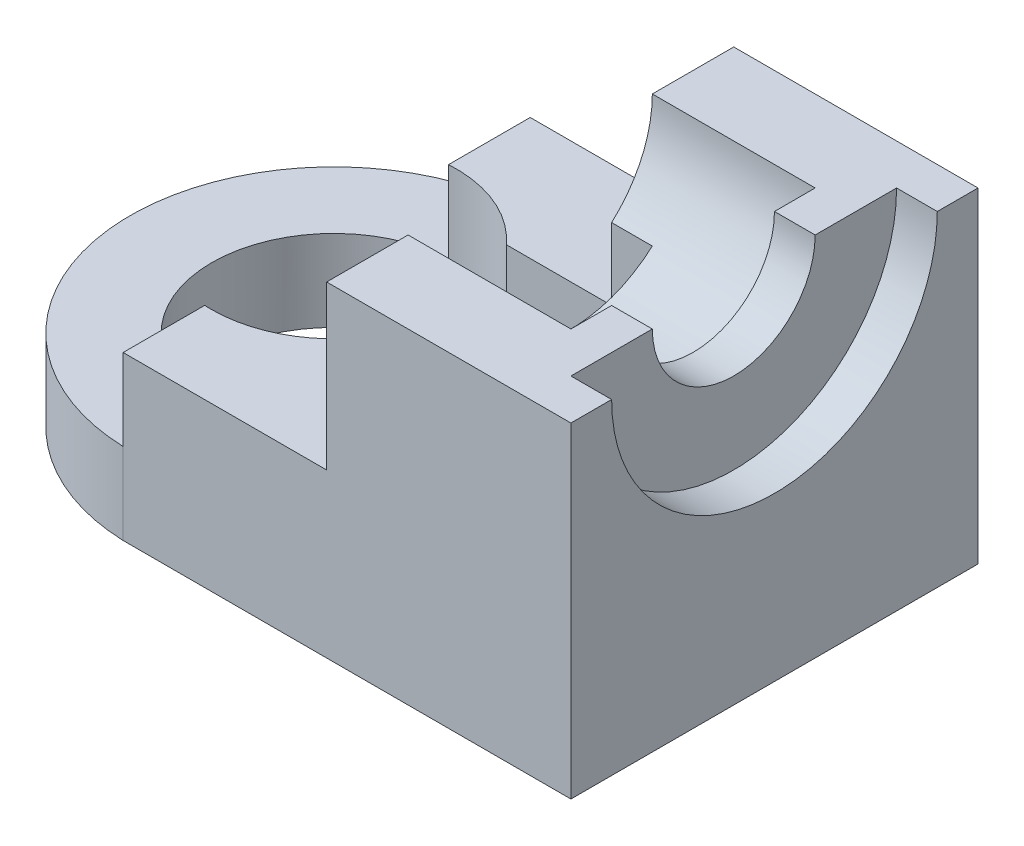
ISO-10303-21;
HEADER;
FILE_DESCRIPTION(('STEP AP214'),'2;1');
FILE_NAME('part.step','',(''),(''),'','','');
FILE_SCHEMA(('AUTOMOTIVE_DESIGN { 1 0 10303 214 1 1 1 1 }'));
ENDSEC;
DATA;
#1=APPLICATION_CONTEXT('core data for automotive mechanical design processes');
#2=APPLICATION_PROTOCOL_DEFINITION('international standard','automotive_design',2000,#1);
#3=PRODUCT_CONTEXT('',#1,'mechanical');
#4=PRODUCT('Part','Part','',(#3));
#5=PRODUCT_RELATED_PRODUCT_CATEGORY('part','',(#4));
#6=PRODUCT_DEFINITION_FORMATION('','',#4);
#7=PRODUCT_DEFINITION_CONTEXT('part definition',#1,'design');
#8=PRODUCT_DEFINITION('design','',#6,#7);
#9=PRODUCT_DEFINITION_SHAPE('','',#8);
#10=(LENGTH_UNIT() NAMED_UNIT(*) SI_UNIT(.MILLI.,.METRE.));
#11=(NAMED_UNIT(*) PLANE_ANGLE_UNIT() SI_UNIT($,.RADIAN.));
#12=(NAMED_UNIT(*) SI_UNIT($,.STERADIAN.) SOLID_ANGLE_UNIT());
#13=UNCERTAINTY_MEASURE_WITH_UNIT(LENGTH_MEASURE(1.E-05),#10,'distance_accuracy_value','');
#14=(GEOMETRIC_REPRESENTATION_CONTEXT(3) GLOBAL_UNCERTAINTY_ASSIGNED_CONTEXT((#13)) GLOBAL_UNIT_ASSIGNED_CONTEXT((#10,
#11,#12)) REPRESENTATION_CONTEXT('',''));
#15=CARTESIAN_POINT('',(0.,0.,0.));
#16=DIRECTION('',(0.,0.,1.));
#17=DIRECTION('',(1.,0.,0.));
#18=AXIS2_PLACEMENT_3D('',#15,#16,#17);
#19=CARTESIAN_POINT('',(5.17622924952847,-14.,0.));
#20=DIRECTION('',(0.,1.,0.));
#21=DIRECTION('',(0.,0.,1.));
#22=AXIS2_PLACEMENT_3D('',#19,#20,#21);
#23=CYLINDRICAL_SURFACE('',#22,3.);
#24=CARTESIAN_POINT('',(5.17622924952847,-4.,0.));
#25=DIRECTION('',(0.,1.,0.));
#26=DIRECTION('',(0.,0.,1.));
#27=AXIS2_PLACEMENT_3D('',#24,#25,#26);
#28=CIRCLE('',#27,3.);
#29=CARTESIAN_POINT('',(5.17622924952847,-4.,3.));
#30=VERTEX_POINT('',#29);
#31=EDGE_CURVE('E289',#30,#30,#28,.T.);
#32=ORIENTED_EDGE('',*,*,#31,.F.);
#33=EDGE_LOOP('',(#32));
#34=FACE_BOUND('',#33,.T.);
#35=DIRECTION('',(0.,1.,0.));
#36=VECTOR('',#35,1.);
#37=CARTESIAN_POINT('',(7.41229722702826,-14.,-2.00000000000001));
#38=LINE('',#37,#36);
#39=CARTESIAN_POINT('',(7.41229722702826,0.,-2.));
#40=VERTEX_POINT('',#39);
#41=CARTESIAN_POINT('',(7.41229722702826,-2.,-2.));
#42=VERTEX_POINT('',#41);
#43=EDGE_CURVE('E191',#40,#42,#38,.F.);
#44=ORIENTED_EDGE('',*,*,#43,.F.);
#45=CARTESIAN_POINT('',(5.17622924952847,0.,0.));
#46=DIRECTION('',(0.,1.,0.));
#47=DIRECTION('',(0.,0.,1.));
#48=AXIS2_PLACEMENT_3D('',#45,#46,#47);
#49=CIRCLE('',#48,3.);
#50=CARTESIAN_POINT('',(5.,0.,-2.99481940216946));
#51=VERTEX_POINT('',#50);
#52=EDGE_CURVE('E234',#51,#40,#49,.F.);
#53=ORIENTED_EDGE('',*,*,#52,.F.);
#54=DIRECTION('',(0.,1.,0.));
#55=VECTOR('',#54,1.);
#56=CARTESIAN_POINT('',(5.,-14.,-2.99481940216946));
#57=LINE('',#56,#55);
#58=CARTESIAN_POINT('',(5.,-2.,-2.99481940216946));
#59=VERTEX_POINT('',#58);
#60=EDGE_CURVE('E243',#51,#59,#57,.F.);
#61=ORIENTED_EDGE('',*,*,#60,.T.);
#62=CARTESIAN_POINT('',(5.17622924952847,-2.,0.));
#63=DIRECTION('',(0.,-1.,0.));
#64=DIRECTION('',(0.,0.,-1.));
#65=AXIS2_PLACEMENT_3D('',#62,#63,#64);
#66=CIRCLE('',#65,3.);
#67=CARTESIAN_POINT('',(5.,-2.,2.99481940216946));
#68=VERTEX_POINT('',#67);
#69=EDGE_CURVE('E329',#59,#68,#66,.F.);
#70=ORIENTED_EDGE('',*,*,#69,.T.);
#71=DIRECTION('',(0.,1.,0.));
#72=VECTOR('',#71,1.);
#73=CARTESIAN_POINT('',(5.,-14.,2.99481940216945));
#74=LINE('',#73,#72);
#75=CARTESIAN_POINT('',(5.,0.,2.99481940216946));
#76=VERTEX_POINT('',#75);
#77=EDGE_CURVE('E245',#68,#76,#74,.T.);
#78=ORIENTED_EDGE('',*,*,#77,.T.);
#79=CARTESIAN_POINT('',(7.41229722702826,0.,2.));
#80=VERTEX_POINT('',#79);
#81=EDGE_CURVE('E232',#80,#76,#49,.F.);
#82=ORIENTED_EDGE('',*,*,#81,.F.);
#83=DIRECTION('',(0.,1.,0.));
#84=VECTOR('',#83,1.);
#85=CARTESIAN_POINT('',(7.41229722702826,-14.,1.99999999999999));
#86=LINE('',#85,#84);
#87=CARTESIAN_POINT('',(7.41229722702826,-2.,2.));
#88=VERTEX_POINT('',#87);
#89=EDGE_CURVE('E206',#88,#80,#86,.T.);
#90=ORIENTED_EDGE('',*,*,#89,.F.);
#91=CARTESIAN_POINT('',(5.17622924952847,-2.,0.));
#92=DIRECTION('',(0.,-1.,0.));
#93=DIRECTION('',(0.,0.,-1.));
#94=AXIS2_PLACEMENT_3D('',#91,#92,#93);
#95=CIRCLE('',#94,3.);
#96=EDGE_CURVE('E11',#88,#42,#95,.F.);
#97=ORIENTED_EDGE('',*,*,#96,.T.);
#98=EDGE_LOOP('',(#44,#53,#61,#70,#78,#82,#90,#97));
#99=FACE_BOUND('',#98,.T.);
#100=ADVANCED_FACE('F33',(#34,#99),#23,.F.);
#101=CARTESIAN_POINT('',(14.,4.,0.));
#102=DIRECTION('',(-1.,0.,0.));
#103=DIRECTION('',(0.,0.,1.));
#104=AXIS2_PLACEMENT_3D('',#101,#102,#103);
#105=CYLINDRICAL_SURFACE('',#104,3.);
#106=CARTESIAN_POINT('',(10.,4.,0.));
#107=DIRECTION('',(1.,0.,0.));
#108=DIRECTION('',(0.,0.,-1.));
#109=AXIS2_PLACEMENT_3D('',#106,#107,#108);
#110=CIRCLE('',#109,3.);
#111=CARTESIAN_POINT('',(10.,1.76393202250021,-2.));
#112=VERTEX_POINT('',#111);
#113=CARTESIAN_POINT('',(10.,4.,-3.));
#114=VERTEX_POINT('',#113);
#115=EDGE_CURVE('E332',#112,#114,#110,.T.);
#116=ORIENTED_EDGE('',*,*,#115,.F.);
#117=DIRECTION('',(-1.,0.,0.));
#118=VECTOR('',#117,1.);
#119=CARTESIAN_POINT('',(14.,1.76393202250021,-2.));
#120=LINE('',#119,#118);
#121=CARTESIAN_POINT('',(11.,1.76393202250021,-2.));
#122=VERTEX_POINT('',#121);
#123=EDGE_CURVE('E211',#112,#122,#120,.F.);
#124=ORIENTED_EDGE('',*,*,#123,.T.);
#125=CARTESIAN_POINT('',(11.,4.,0.));
#126=DIRECTION('',(-1.,0.,0.));
#127=DIRECTION('',(0.,0.,1.));
#128=AXIS2_PLACEMENT_3D('',#125,#126,#127);
#129=CIRCLE('',#128,3.);
#130=CARTESIAN_POINT('',(11.,1.76393202250021,2.));
#131=VERTEX_POINT('',#130);
#132=EDGE_CURVE('E41',#122,#131,#129,.T.);
#133=ORIENTED_EDGE('',*,*,#132,.T.);
#134=DIRECTION('',(-1.,0.,0.));
#135=VECTOR('',#134,1.);
#136=CARTESIAN_POINT('',(14.,1.76393202250021,2.));
#137=LINE('',#136,#135);
#138=CARTESIAN_POINT('',(10.,1.76393202250021,2.));
#139=VERTEX_POINT('',#138);
#140=EDGE_CURVE('E203',#131,#139,#137,.T.);
#141=ORIENTED_EDGE('',*,*,#140,.T.);
#142=CARTESIAN_POINT('',(10.,4.,3.));
#143=VERTEX_POINT('',#142);
#144=EDGE_CURVE('E333',#143,#139,#110,.T.);
#145=ORIENTED_EDGE('',*,*,#144,.F.);
#146=DIRECTION('',(-1.,0.,0.));
#147=VECTOR('',#146,1.);
#148=CARTESIAN_POINT('',(14.,4.,3.));
#149=LINE('',#148,#147);
#150=CARTESIAN_POINT('',(14.,4.,3.));
#151=VERTEX_POINT('',#150);
#152=EDGE_CURVE('E256',#143,#151,#149,.F.);
#153=ORIENTED_EDGE('',*,*,#152,.T.);
#154=CARTESIAN_POINT('',(14.,4.,0.));
#155=DIRECTION('',(1.,0.,0.));
#156=DIRECTION('',(0.,0.,-1.));
#157=AXIS2_PLACEMENT_3D('',#154,#155,#156);
#158=CIRCLE('',#157,3.);
#159=CARTESIAN_POINT('',(14.,4.,-3.));
#160=VERTEX_POINT('',#159);
#161=EDGE_CURVE('E253',#151,#160,#158,.T.);
#162=ORIENTED_EDGE('',*,*,#161,.T.);
#163=DIRECTION('',(-1.,0.,0.));
#164=VECTOR('',#163,1.);
#165=CARTESIAN_POINT('',(14.,4.,-3.));
#166=LINE('',#165,#164);
#167=EDGE_CURVE('E258',#160,#114,#166,.T.);
#168=ORIENTED_EDGE('',*,*,#167,.T.);
#169=EDGE_LOOP('',(#116,#124,#133,#141,#145,#153,#162,#168));
#170=FACE_BOUND('',#169,.T.);
#171=ADVANCED_FACE('F341',(#170),#105,.F.);
#172=CARTESIAN_POINT('',(0.,0.,0.));
#173=DIRECTION('',(0.,1.,0.));
#174=DIRECTION('',(0.,0.,1.));
#175=AXIS2_PLACEMENT_3D('',#172,#173,#174);
#176=PLANE('',#175);
#177=ORIENTED_EDGE('',*,*,#52,.T.);
#178=DIRECTION('',(1.,0.,0.));
#179=VECTOR('',#178,1.);
#180=CARTESIAN_POINT('',(0.,0.,-2.));
#181=LINE('',#180,#179);
#182=CARTESIAN_POINT('',(10.,0.,-2.));
#183=VERTEX_POINT('',#182);
#184=EDGE_CURVE('E208',#40,#183,#181,.T.);
#185=ORIENTED_EDGE('',*,*,#184,.T.);
#186=DIRECTION('',(0.,0.,-1.));
#187=VECTOR('',#186,1.);
#188=CARTESIAN_POINT('',(10.,0.,-5.));
#189=LINE('',#188,#187);
#190=CARTESIAN_POINT('',(10.,0.,-5.));
#191=VERTEX_POINT('',#190);
#192=EDGE_CURVE('E221',#183,#191,#189,.T.);
#193=ORIENTED_EDGE('',*,*,#192,.T.);
#194=DIRECTION('',(-1.,0.,0.));
#195=VECTOR('',#194,1.);
#196=CARTESIAN_POINT('',(5.,0.,-5.));
#197=LINE('',#196,#195);
#198=CARTESIAN_POINT('',(5.,0.,-5.));
#199=VERTEX_POINT('',#198);
#200=EDGE_CURVE('E56',#191,#199,#197,.T.);
#201=ORIENTED_EDGE('',*,*,#200,.T.);
#202=DIRECTION('',(0.,0.,1.));
#203=VECTOR('',#202,1.);
#204=CARTESIAN_POINT('',(5.,0.,-5.));
#205=LINE('',#204,#203);
#206=EDGE_CURVE('E215',#199,#51,#205,.T.);
#207=ORIENTED_EDGE('',*,*,#206,.T.);
#208=EDGE_LOOP('',(#177,#185,#193,#201,#207));
#209=FACE_BOUND('',#208,.T.);
#210=ADVANCED_FACE('F349',(#209),#176,.T.);
#211=CARTESIAN_POINT('',(10.,0.,5.));
#212=VERTEX_POINT('',#211);
#213=CARTESIAN_POINT('',(10.,0.,2.));
#214=VERTEX_POINT('',#213);
#215=EDGE_CURVE('E222',#212,#214,#189,.T.);
#216=ORIENTED_EDGE('',*,*,#215,.T.);
#217=DIRECTION('',(-1.,0.,0.));
#218=VECTOR('',#217,1.);
#219=CARTESIAN_POINT('',(0.,0.,2.));
#220=LINE('',#219,#218);
#221=EDGE_CURVE('E48',#214,#80,#220,.T.);
#222=ORIENTED_EDGE('',*,*,#221,.T.);
#223=ORIENTED_EDGE('',*,*,#81,.T.);
#224=CARTESIAN_POINT('',(5.,0.,5.));
#225=VERTEX_POINT('',#224);
#226=EDGE_CURVE('E218',#76,#225,#205,.T.);
#227=ORIENTED_EDGE('',*,*,#226,.T.);
#228=DIRECTION('',(1.,0.,0.));
#229=VECTOR('',#228,1.);
#230=CARTESIAN_POINT('',(5.,0.,5.));
#231=LINE('',#230,#229);
#232=EDGE_CURVE('E217',#225,#212,#231,.T.);
#233=ORIENTED_EDGE('',*,*,#232,.T.);
#234=EDGE_LOOP('',(#216,#222,#223,#227,#233));
#235=FACE_BOUND('',#234,.T.);
#236=ADVANCED_FACE('F359',(#235),#176,.T.);
#237=CARTESIAN_POINT('',(10.,0.,-5.));
#238=DIRECTION('',(1.,0.,0.));
#239=DIRECTION('',(0.,0.,-1.));
#240=AXIS2_PLACEMENT_3D('',#237,#238,#239);
#241=PLANE('',#240);
#242=DIRECTION('',(0.,-1.,0.));
#243=VECTOR('',#242,1.);
#244=CARTESIAN_POINT('',(10.,0.,-2.));
#245=LINE('',#244,#243);
#246=EDGE_CURVE('E338',#112,#183,#245,.T.);
#247=ORIENTED_EDGE('',*,*,#246,.F.);
#248=ORIENTED_EDGE('',*,*,#115,.T.);
#249=DIRECTION('',(0.,0.,-1.));
#250=VECTOR('',#249,1.);
#251=CARTESIAN_POINT('',(10.,4.,-5.));
#252=LINE('',#251,#250);
#253=CARTESIAN_POINT('',(10.,4.,-5.));
#254=VERTEX_POINT('',#253);
#255=EDGE_CURVE('E214',#114,#254,#252,.T.);
#256=ORIENTED_EDGE('',*,*,#255,.T.);
#257=DIRECTION('',(0.,1.,0.));
#258=VECTOR('',#257,1.);
#259=CARTESIAN_POINT('',(10.,0.,-5.));
#260=LINE('',#259,#258);
#261=EDGE_CURVE('E229',#191,#254,#260,.T.);
#262=ORIENTED_EDGE('',*,*,#261,.F.);
#263=ORIENTED_EDGE('',*,*,#192,.F.);
#264=EDGE_LOOP('',(#247,#248,#256,#262,#263));
#265=FACE_BOUND('',#264,.T.);
#266=ADVANCED_FACE('F346',(#265),#241,.F.);
#267=DIRECTION('',(0.,1.,0.));
#268=VECTOR('',#267,1.);
#269=CARTESIAN_POINT('',(10.,0.,2.));
#270=LINE('',#269,#268);
#271=EDGE_CURVE('E336',#214,#139,#270,.T.);
#272=ORIENTED_EDGE('',*,*,#271,.F.);
#273=ORIENTED_EDGE('',*,*,#215,.F.);
#274=DIRECTION('',(0.,1.,0.));
#275=VECTOR('',#274,1.);
#276=CARTESIAN_POINT('',(10.,0.,5.));
#277=LINE('',#276,#275);
#278=CARTESIAN_POINT('',(10.,4.,5.));
#279=VERTEX_POINT('',#278);
#280=EDGE_CURVE('E226',#212,#279,#277,.T.);
#281=ORIENTED_EDGE('',*,*,#280,.T.);
#282=EDGE_CURVE('E227',#279,#143,#252,.T.);
#283=ORIENTED_EDGE('',*,*,#282,.T.);
#284=ORIENTED_EDGE('',*,*,#144,.T.);
#285=EDGE_LOOP('',(#272,#273,#281,#283,#284));
#286=FACE_BOUND('',#285,.T.);
#287=ADVANCED_FACE('F357',(#286),#241,.F.);
#288=CARTESIAN_POINT('',(5.,-2.,-5.));
#289=DIRECTION('',(1.,0.,0.));
#290=DIRECTION('',(0.,0.,-1.));
#291=AXIS2_PLACEMENT_3D('',#288,#289,#290);
#292=PLANE('',#291);
#293=ORIENTED_EDGE('',*,*,#226,.F.);
#294=ORIENTED_EDGE('',*,*,#77,.F.);
#295=DIRECTION('',(0.,0.,-1.));
#296=VECTOR('',#295,1.);
#297=CARTESIAN_POINT('',(5.,-2.,-5.));
#298=LINE('',#297,#296);
#299=CARTESIAN_POINT('',(5.,-2.,5.));
#300=VERTEX_POINT('',#299);
#301=EDGE_CURVE('E239',#300,#68,#298,.T.);
#302=ORIENTED_EDGE('',*,*,#301,.F.);
#303=DIRECTION('',(0.,-1.,0.));
#304=VECTOR('',#303,1.);
#305=CARTESIAN_POINT('',(5.,-4.,5.));
#306=LINE('',#305,#304);
#307=EDGE_CURVE('E248',#225,#300,#306,.T.);
#308=ORIENTED_EDGE('',*,*,#307,.F.);
#309=EDGE_LOOP('',(#293,#294,#302,#308));
#310=FACE_BOUND('',#309,.T.);
#311=ADVANCED_FACE('F412',(#310),#292,.F.);
#312=ORIENTED_EDGE('',*,*,#206,.F.);
#313=DIRECTION('',(0.,1.,0.));
#314=VECTOR('',#313,1.);
#315=CARTESIAN_POINT('',(5.,-2.,-5.));
#316=LINE('',#315,#314);
#317=CARTESIAN_POINT('',(5.,-2.,-5.));
#318=VERTEX_POINT('',#317);
#319=EDGE_CURVE('E240',#318,#199,#316,.T.);
#320=ORIENTED_EDGE('',*,*,#319,.F.);
#321=EDGE_CURVE('E237',#59,#318,#298,.T.);
#322=ORIENTED_EDGE('',*,*,#321,.F.);
#323=ORIENTED_EDGE('',*,*,#60,.F.);
#324=EDGE_LOOP('',(#312,#320,#322,#323));
#325=FACE_BOUND('',#324,.T.);
#326=ADVANCED_FACE('F401',(#325),#292,.F.);
#327=CARTESIAN_POINT('',(16.,4.,-5.));
#328=DIRECTION('',(0.,-1.,0.));
#329=DIRECTION('',(0.,0.,-1.));
#330=AXIS2_PLACEMENT_3D('',#327,#328,#329);
#331=PLANE('',#330);
#332=DIRECTION('',(-1.,0.,0.));
#333=VECTOR('',#332,1.);
#334=CARTESIAN_POINT('',(16.,4.,-5.));
#335=LINE('',#334,#333);
#336=CARTESIAN_POINT('',(16.,4.,-5.));
#337=VERTEX_POINT('',#336);
#338=EDGE_CURVE('E313',#337,#254,#335,.T.);
#339=ORIENTED_EDGE('',*,*,#338,.T.);
#340=ORIENTED_EDGE('',*,*,#255,.F.);
#341=ORIENTED_EDGE('',*,*,#167,.F.);
#342=DIRECTION('',(0.,0.,1.));
#343=VECTOR('',#342,1.);
#344=CARTESIAN_POINT('',(14.,4.,-5.));
#345=LINE('',#344,#343);
#346=CARTESIAN_POINT('',(14.,4.,-2.));
#347=VERTEX_POINT('',#346);
#348=EDGE_CURVE('E264',#160,#347,#345,.T.);
#349=ORIENTED_EDGE('',*,*,#348,.T.);
#350=DIRECTION('',(-1.,0.,0.));
#351=VECTOR('',#350,1.);
#352=CARTESIAN_POINT('',(16.,4.,-2.));
#353=LINE('',#352,#351);
#354=CARTESIAN_POINT('',(15.,4.,-2.));
#355=VERTEX_POINT('',#354);
#356=EDGE_CURVE('E310',#355,#347,#353,.T.);
#357=ORIENTED_EDGE('',*,*,#356,.F.);
#358=DIRECTION('',(0.,0.,1.));
#359=VECTOR('',#358,1.);
#360=CARTESIAN_POINT('',(15.,4.,-5.));
#361=LINE('',#360,#359);
#362=CARTESIAN_POINT('',(15.,4.,-4.));
#363=VERTEX_POINT('',#362);
#364=EDGE_CURVE('E278',#363,#355,#361,.T.);
#365=ORIENTED_EDGE('',*,*,#364,.F.);
#366=DIRECTION('',(1.,0.,0.));
#367=VECTOR('',#366,1.);
#368=CARTESIAN_POINT('',(15.,4.,-4.));
#369=LINE('',#368,#367);
#370=CARTESIAN_POINT('',(16.,4.,-4.));
#371=VERTEX_POINT('',#370);
#372=EDGE_CURVE('E273',#363,#371,#369,.T.);
#373=ORIENTED_EDGE('',*,*,#372,.T.);
#374=DIRECTION('',(0.,0.,1.));
#375=VECTOR('',#374,1.);
#376=CARTESIAN_POINT('',(16.,4.,-5.));
#377=LINE('',#376,#375);
#378=EDGE_CURVE('E299',#337,#371,#377,.T.);
#379=ORIENTED_EDGE('',*,*,#378,.F.);
#380=EDGE_LOOP('',(#339,#340,#341,#349,#357,#365,#373,#379));
#381=FACE_BOUND('',#380,.T.);
#382=ADVANCED_FACE('F378',(#381),#331,.F.);
#383=CARTESIAN_POINT('',(16.,4.,2.));
#384=DIRECTION('',(0.,-1.,0.));
#385=DIRECTION('',(0.,0.,-1.));
#386=AXIS2_PLACEMENT_3D('',#383,#384,#385);
#387=PLANE('',#386);
#388=ORIENTED_EDGE('',*,*,#152,.F.);
#389=ORIENTED_EDGE('',*,*,#282,.F.);
#390=DIRECTION('',(-1.,0.,0.));
#391=VECTOR('',#390,1.);
#392=CARTESIAN_POINT('',(16.,4.,5.));
#393=LINE('',#392,#391);
#394=CARTESIAN_POINT('',(16.,4.,5.));
#395=VERTEX_POINT('',#394);
#396=EDGE_CURVE('E304',#395,#279,#393,.T.);
#397=ORIENTED_EDGE('',*,*,#396,.F.);
#398=DIRECTION('',(0.,0.,1.));
#399=VECTOR('',#398,1.);
#400=CARTESIAN_POINT('',(16.,4.,2.));
#401=LINE('',#400,#399);
#402=CARTESIAN_POINT('',(16.,4.,4.));
#403=VERTEX_POINT('',#402);
#404=EDGE_CURVE('E302',#403,#395,#401,.T.);
#405=ORIENTED_EDGE('',*,*,#404,.F.);
#406=DIRECTION('',(1.,0.,0.));
#407=VECTOR('',#406,1.);
#408=CARTESIAN_POINT('',(15.,4.,4.));
#409=LINE('',#408,#407);
#410=CARTESIAN_POINT('',(15.,4.,4.));
#411=VERTEX_POINT('',#410);
#412=EDGE_CURVE('E270',#403,#411,#409,.F.);
#413=ORIENTED_EDGE('',*,*,#412,.T.);
#414=DIRECTION('',(0.,0.,1.));
#415=VECTOR('',#414,1.);
#416=CARTESIAN_POINT('',(15.,4.,2.));
#417=LINE('',#416,#415);
#418=CARTESIAN_POINT('',(15.,4.,2.));
#419=VERTEX_POINT('',#418);
#420=EDGE_CURVE('E324',#419,#411,#417,.T.);
#421=ORIENTED_EDGE('',*,*,#420,.F.);
#422=DIRECTION('',(-1.,0.,0.));
#423=VECTOR('',#422,1.);
#424=CARTESIAN_POINT('',(16.,4.,2.));
#425=LINE('',#424,#423);
#426=CARTESIAN_POINT('',(14.,4.,2.));
#427=VERTEX_POINT('',#426);
#428=EDGE_CURVE('E307',#419,#427,#425,.T.);
#429=ORIENTED_EDGE('',*,*,#428,.T.);
#430=DIRECTION('',(0.,0.,1.));
#431=VECTOR('',#430,1.);
#432=CARTESIAN_POINT('',(14.,4.,2.));
#433=LINE('',#432,#431);
#434=EDGE_CURVE('E326',#427,#151,#433,.T.);
#435=ORIENTED_EDGE('',*,*,#434,.T.);
#436=EDGE_LOOP('',(#388,#389,#397,#405,#413,#421,#429,#435));
#437=FACE_BOUND('',#436,.T.);
#438=ADVANCED_FACE('F370',(#437),#387,.F.);
#439=CARTESIAN_POINT('',(5.17622924952847,-14.,0.));
#440=DIRECTION('',(0.,1.,0.));
#441=DIRECTION('',(0.,0.,1.));
#442=AXIS2_PLACEMENT_3D('',#439,#440,#441);
#443=CYLINDRICAL_SURFACE('',#442,5.00310471091595);
#444=DIRECTION('',(0.,1.,0.));
#445=VECTOR('',#444,1.);
#446=CARTESIAN_POINT('',(5.,-14.,4.99999999999999));
#447=LINE('',#446,#445);
#448=CARTESIAN_POINT('',(5.,-4.,5.));
#449=VERTEX_POINT('',#448);
#450=EDGE_CURVE('E281',#449,#300,#447,.T.);
#451=ORIENTED_EDGE('',*,*,#450,.T.);
#452=CARTESIAN_POINT('',(5.17622924952847,-2.,0.));
#453=DIRECTION('',(0.,-1.,0.));
#454=DIRECTION('',(0.,0.,-1.));
#455=AXIS2_PLACEMENT_3D('',#452,#453,#454);
#456=CIRCLE('',#455,5.00310471091595);
#457=EDGE_CURVE('E250',#300,#318,#456,.T.);
#458=ORIENTED_EDGE('',*,*,#457,.T.);
#459=DIRECTION('',(0.,1.,0.));
#460=VECTOR('',#459,1.);
#461=CARTESIAN_POINT('',(5.,-14.,-5.00000000000001));
#462=LINE('',#461,#460);
#463=CARTESIAN_POINT('',(5.,-4.,-5.));
#464=VERTEX_POINT('',#463);
#465=EDGE_CURVE('E280',#464,#318,#462,.T.);
#466=ORIENTED_EDGE('',*,*,#465,.F.);
#467=CARTESIAN_POINT('',(5.17622924952847,-4.,0.));
#468=DIRECTION('',(0.,1.,0.));
#469=DIRECTION('',(0.,0.,1.));
#470=AXIS2_PLACEMENT_3D('',#467,#468,#469);
#471=CIRCLE('',#470,5.00310471091595);
#472=EDGE_CURVE('E284',#449,#464,#471,.F.);
#473=ORIENTED_EDGE('',*,*,#472,.F.);
#474=EDGE_LOOP('',(#451,#458,#466,#473));
#475=FACE_BOUND('',#474,.T.);
#476=ADVANCED_FACE('F404',(#475),#443,.T.);
#477=CARTESIAN_POINT('',(16.,4.,0.));
#478=DIRECTION('',(-1.,0.,0.));
#479=DIRECTION('',(0.,0.,1.));
#480=AXIS2_PLACEMENT_3D('',#477,#478,#479);
#481=CYLINDRICAL_SURFACE('',#480,2.);
#482=ORIENTED_EDGE('',*,*,#356,.T.);
#483=CARTESIAN_POINT('',(14.,4.,0.));
#484=DIRECTION('',(1.,0.,0.));
#485=DIRECTION('',(0.,0.,-1.));
#486=AXIS2_PLACEMENT_3D('',#483,#484,#485);
#487=CIRCLE('',#486,2.);
#488=EDGE_CURVE('E261',#347,#427,#487,.F.);
#489=ORIENTED_EDGE('',*,*,#488,.T.);
#490=ORIENTED_EDGE('',*,*,#428,.F.);
#491=CARTESIAN_POINT('',(15.,4.,0.));
#492=DIRECTION('',(1.,0.,0.));
#493=DIRECTION('',(0.,0.,-1.));
#494=AXIS2_PLACEMENT_3D('',#491,#492,#493);
#495=CIRCLE('',#494,2.);
#496=EDGE_CURVE('E276',#355,#419,#495,.F.);
#497=ORIENTED_EDGE('',*,*,#496,.F.);
#498=EDGE_LOOP('',(#482,#489,#490,#497));
#499=FACE_BOUND('',#498,.T.);
#500=ADVANCED_FACE('F382',(#499),#481,.F.);
#501=CARTESIAN_POINT('',(16.,-4.,5.));
#502=DIRECTION('',(0.,0.,-1.));
#503=DIRECTION('',(-1.,0.,0.));
#504=AXIS2_PLACEMENT_3D('',#501,#502,#503);
#505=PLANE('',#504);
#506=ORIENTED_EDGE('',*,*,#396,.T.);
#507=ORIENTED_EDGE('',*,*,#280,.F.);
#508=ORIENTED_EDGE('',*,*,#232,.F.);
#509=ORIENTED_EDGE('',*,*,#307,.T.);
#510=ORIENTED_EDGE('',*,*,#450,.F.);
#511=DIRECTION('',(-1.,0.,0.));
#512=VECTOR('',#511,1.);
#513=CARTESIAN_POINT('',(16.,-4.,5.));
#514=LINE('',#513,#512);
#515=CARTESIAN_POINT('',(16.,-4.,5.));
#516=VERTEX_POINT('',#515);
#517=EDGE_CURVE('E319',#516,#449,#514,.T.);
#518=ORIENTED_EDGE('',*,*,#517,.F.);
#519=DIRECTION('',(0.,-1.,0.));
#520=VECTOR('',#519,1.);
#521=CARTESIAN_POINT('',(16.,-4.,5.));
#522=LINE('',#521,#520);
#523=EDGE_CURVE('E292',#395,#516,#522,.T.);
#524=ORIENTED_EDGE('',*,*,#523,.F.);
#525=EDGE_LOOP('',(#506,#507,#508,#509,#510,#518,#524));
#526=FACE_BOUND('',#525,.T.);
#527=ADVANCED_FACE('F35',(#526),#505,.F.);
#528=CARTESIAN_POINT('',(16.,-4.,-5.));
#529=DIRECTION('',(0.,1.,0.));
#530=DIRECTION('',(0.,0.,1.));
#531=AXIS2_PLACEMENT_3D('',#528,#529,#530);
#532=PLANE('',#531);
#533=ORIENTED_EDGE('',*,*,#31,.T.);
#534=EDGE_LOOP('',(#533));
#535=FACE_BOUND('',#534,.T.);
#536=ORIENTED_EDGE('',*,*,#517,.T.);
#537=ORIENTED_EDGE('',*,*,#472,.T.);
#538=DIRECTION('',(-1.,0.,0.));
#539=VECTOR('',#538,1.);
#540=CARTESIAN_POINT('',(16.,-4.,-5.));
#541=LINE('',#540,#539);
#542=CARTESIAN_POINT('',(16.,-4.,-5.));
#543=VERTEX_POINT('',#542);
#544=EDGE_CURVE('E316',#543,#464,#541,.T.);
#545=ORIENTED_EDGE('',*,*,#544,.F.);
#546=DIRECTION('',(0.,0.,-1.));
#547=VECTOR('',#546,1.);
#548=CARTESIAN_POINT('',(16.,-4.,-5.));
#549=LINE('',#548,#547);
#550=EDGE_CURVE('E295',#516,#543,#549,.T.);
#551=ORIENTED_EDGE('',*,*,#550,.F.);
#552=EDGE_LOOP('',(#536,#537,#545,#551));
#553=FACE_BOUND('',#552,.T.);
#554=ADVANCED_FACE('F415',(#535,#553),#532,.F.);
#555=CARTESIAN_POINT('',(16.,-4.,-5.));
#556=DIRECTION('',(0.,0.,1.));
#557=DIRECTION('',(1.,0.,0.));
#558=AXIS2_PLACEMENT_3D('',#555,#556,#557);
#559=PLANE('',#558);
#560=ORIENTED_EDGE('',*,*,#200,.F.);
#561=ORIENTED_EDGE('',*,*,#261,.T.);
#562=ORIENTED_EDGE('',*,*,#338,.F.);
#563=DIRECTION('',(0.,1.,0.));
#564=VECTOR('',#563,1.);
#565=CARTESIAN_POINT('',(16.,-4.,-5.));
#566=LINE('',#565,#564);
#567=EDGE_CURVE('E297',#543,#337,#566,.T.);
#568=ORIENTED_EDGE('',*,*,#567,.F.);
#569=ORIENTED_EDGE('',*,*,#544,.T.);
#570=ORIENTED_EDGE('',*,*,#465,.T.);
#571=ORIENTED_EDGE('',*,*,#319,.T.);
#572=EDGE_LOOP('',(#560,#561,#562,#568,#569,#570,#571));
#573=FACE_BOUND('',#572,.T.);
#574=ADVANCED_FACE('F397',(#573),#559,.F.);
#575=CARTESIAN_POINT('',(16.,4.,0.));
#576=DIRECTION('',(1.,0.,0.));
#577=DIRECTION('',(0.,0.,-1.));
#578=AXIS2_PLACEMENT_3D('',#575,#576,#577);
#579=PLANE('',#578);
#580=CARTESIAN_POINT('',(16.,4.,0.));
#581=DIRECTION('',(1.,0.,0.));
#582=DIRECTION('',(0.,0.,-1.));
#583=AXIS2_PLACEMENT_3D('',#580,#581,#582);
#584=CIRCLE('',#583,4.);
#585=EDGE_CURVE('E322',#403,#371,#584,.T.);
#586=ORIENTED_EDGE('',*,*,#585,.F.);
#587=ORIENTED_EDGE('',*,*,#404,.T.);
#588=ORIENTED_EDGE('',*,*,#523,.T.);
#589=ORIENTED_EDGE('',*,*,#550,.T.);
#590=ORIENTED_EDGE('',*,*,#567,.T.);
#591=ORIENTED_EDGE('',*,*,#378,.T.);
#592=EDGE_LOOP('',(#586,#587,#588,#589,#590,#591));
#593=FACE_BOUND('',#592,.T.);
#594=ADVANCED_FACE('F392',(#593),#579,.T.);
#595=CARTESIAN_POINT('',(15.,4.,0.));
#596=DIRECTION('',(1.,0.,0.));
#597=DIRECTION('',(0.,0.,-1.));
#598=AXIS2_PLACEMENT_3D('',#595,#596,#597);
#599=PLANE('',#598);
#600=ORIENTED_EDGE('',*,*,#364,.T.);
#601=ORIENTED_EDGE('',*,*,#496,.T.);
#602=ORIENTED_EDGE('',*,*,#420,.T.);
#603=CARTESIAN_POINT('',(15.,4.,0.));
#604=DIRECTION('',(1.,0.,0.));
#605=DIRECTION('',(0.,0.,-1.));
#606=AXIS2_PLACEMENT_3D('',#603,#604,#605);
#607=CIRCLE('',#606,4.);
#608=EDGE_CURVE('E267',#411,#363,#607,.T.);
#609=ORIENTED_EDGE('',*,*,#608,.T.);
#610=EDGE_LOOP('',(#600,#601,#602,#609));
#611=FACE_BOUND('',#610,.T.);
#612=ADVANCED_FACE('F386',(#611),#599,.T.);
#613=CARTESIAN_POINT('',(15.,4.,0.));
#614=DIRECTION('',(1.,0.,0.));
#615=DIRECTION('',(0.,0.,-1.));
#616=AXIS2_PLACEMENT_3D('',#613,#614,#615);
#617=CYLINDRICAL_SURFACE('',#616,4.);
#618=ORIENTED_EDGE('',*,*,#608,.F.);
#619=ORIENTED_EDGE('',*,*,#412,.F.);
#620=ORIENTED_EDGE('',*,*,#585,.T.);
#621=ORIENTED_EDGE('',*,*,#372,.F.);
#622=EDGE_LOOP('',(#618,#619,#620,#621));
#623=FACE_BOUND('',#622,.T.);
#624=ADVANCED_FACE('F390',(#623),#617,.F.);
#625=CARTESIAN_POINT('',(14.,4.,0.));
#626=DIRECTION('',(1.,0.,0.));
#627=DIRECTION('',(0.,0.,-1.));
#628=AXIS2_PLACEMENT_3D('',#625,#626,#627);
#629=PLANE('',#628);
#630=ORIENTED_EDGE('',*,*,#161,.F.);
#631=ORIENTED_EDGE('',*,*,#434,.F.);
#632=ORIENTED_EDGE('',*,*,#488,.F.);
#633=ORIENTED_EDGE('',*,*,#348,.F.);
#634=EDGE_LOOP('',(#630,#631,#632,#633));
#635=FACE_BOUND('',#634,.T.);
#636=ADVANCED_FACE('F375',(#635),#629,.F.);
#637=CARTESIAN_POINT('',(0.,-2.,0.));
#638=DIRECTION('',(0.,-1.,0.));
#639=DIRECTION('',(0.,0.,-1.));
#640=AXIS2_PLACEMENT_3D('',#637,#638,#639);
#641=PLANE('',#640);
#642=ORIENTED_EDGE('',*,*,#301,.T.);
#643=ORIENTED_EDGE('',*,*,#69,.F.);
#644=ORIENTED_EDGE('',*,*,#321,.T.);
#645=ORIENTED_EDGE('',*,*,#457,.F.);
#646=EDGE_LOOP('',(#642,#643,#644,#645));
#647=FACE_BOUND('',#646,.T.);
#648=ADVANCED_FACE('F409',(#647),#641,.F.);
#649=CARTESIAN_POINT('',(0.,-2.,0.));
#650=DIRECTION('',(0.,-1.,0.));
#651=DIRECTION('',(0.,0.,-1.));
#652=AXIS2_PLACEMENT_3D('',#649,#650,#651);
#653=PLANE('',#652);
#654=DIRECTION('',(1.,0.,0.));
#655=VECTOR('',#654,1.);
#656=CARTESIAN_POINT('',(11.,-2.,2.));
#657=LINE('',#656,#655);
#658=CARTESIAN_POINT('',(11.,-2.,2.));
#659=VERTEX_POINT('',#658);
#660=EDGE_CURVE('E193',#88,#659,#657,.T.);
#661=ORIENTED_EDGE('',*,*,#660,.T.);
#662=DIRECTION('',(0.,0.,-1.));
#663=VECTOR('',#662,1.);
#664=CARTESIAN_POINT('',(11.,-2.,-2.));
#665=LINE('',#664,#663);
#666=CARTESIAN_POINT('',(11.,-2.,-2.));
#667=VERTEX_POINT('',#666);
#668=EDGE_CURVE('E181',#659,#667,#665,.T.);
#669=ORIENTED_EDGE('',*,*,#668,.T.);
#670=DIRECTION('',(-1.,0.,0.));
#671=VECTOR('',#670,1.);
#672=CARTESIAN_POINT('',(11.,-2.,-2.));
#673=LINE('',#672,#671);
#674=EDGE_CURVE('E188',#667,#42,#673,.T.);
#675=ORIENTED_EDGE('',*,*,#674,.T.);
#676=ORIENTED_EDGE('',*,*,#96,.F.);
#677=EDGE_LOOP('',(#661,#669,#675,#676));
#678=FACE_BOUND('',#677,.T.);
#679=ADVANCED_FACE('F196',(#678),#653,.F.);
#680=CARTESIAN_POINT('',(11.,4.,-2.));
#681=DIRECTION('',(0.,0.,1.));
#682=DIRECTION('',(0.,-1.,0.));
#683=AXIS2_PLACEMENT_3D('',#680,#681,#682);
#684=PLANE('',#683);
#685=ORIENTED_EDGE('',*,*,#43,.T.);
#686=ORIENTED_EDGE('',*,*,#674,.F.);
#687=DIRECTION('',(0.,-1.,0.));
#688=VECTOR('',#687,1.);
#689=CARTESIAN_POINT('',(11.,4.,-2.));
#690=LINE('',#689,#688);
#691=EDGE_CURVE('E176',#122,#667,#690,.T.);
#692=ORIENTED_EDGE('',*,*,#691,.F.);
#693=ORIENTED_EDGE('',*,*,#123,.F.);
#694=ORIENTED_EDGE('',*,*,#246,.T.);
#695=ORIENTED_EDGE('',*,*,#184,.F.);
#696=EDGE_LOOP('',(#685,#686,#692,#693,#694,#695));
#697=FACE_BOUND('',#696,.T.);
#698=ADVANCED_FACE('F189',(#697),#684,.T.);
#699=CARTESIAN_POINT('',(11.,4.,2.));
#700=DIRECTION('',(0.,0.,-1.));
#701=DIRECTION('',(0.,1.,0.));
#702=AXIS2_PLACEMENT_3D('',#699,#700,#701);
#703=PLANE('',#702);
#704=ORIENTED_EDGE('',*,*,#89,.T.);
#705=ORIENTED_EDGE('',*,*,#221,.F.);
#706=ORIENTED_EDGE('',*,*,#271,.T.);
#707=ORIENTED_EDGE('',*,*,#140,.F.);
#708=DIRECTION('',(0.,-1.,0.));
#709=VECTOR('',#708,1.);
#710=CARTESIAN_POINT('',(11.,4.,2.));
#711=LINE('',#710,#709);
#712=EDGE_CURVE('E185',#131,#659,#711,.T.);
#713=ORIENTED_EDGE('',*,*,#712,.T.);
#714=ORIENTED_EDGE('',*,*,#660,.F.);
#715=EDGE_LOOP('',(#704,#705,#706,#707,#713,#714));
#716=FACE_BOUND('',#715,.T.);
#717=ADVANCED_FACE('F355',(#716),#703,.T.);
#718=CARTESIAN_POINT('',(11.,4.,-2.));
#719=DIRECTION('',(-1.,0.,0.));
#720=DIRECTION('',(0.,0.,1.));
#721=AXIS2_PLACEMENT_3D('',#718,#719,#720);
#722=PLANE('',#721);
#723=ORIENTED_EDGE('',*,*,#691,.T.);
#724=ORIENTED_EDGE('',*,*,#668,.F.);
#725=ORIENTED_EDGE('',*,*,#712,.F.);
#726=ORIENTED_EDGE('',*,*,#132,.F.);
#727=EDGE_LOOP('',(#723,#724,#725,#726));
#728=FACE_BOUND('',#727,.T.);
#729=ADVANCED_FACE('F178',(#728),#722,.T.);
#730=CLOSED_SHELL('',(#100,#171,#210,#236,#266,#287,#311,#326,#382,#438,#476,#500,#527,#554,
#574,#594,#612,#624,#636,#648,#679,#698,#717,#729));
#731=MANIFOLD_SOLID_BREP('B2',#730);
#732=ADVANCED_BREP_SHAPE_REPRESENTATION('',(#18,#731),#14);
#733=SHAPE_DEFINITION_REPRESENTATION(#9,#732);
ENDSEC;
END-ISO-10303-21;
